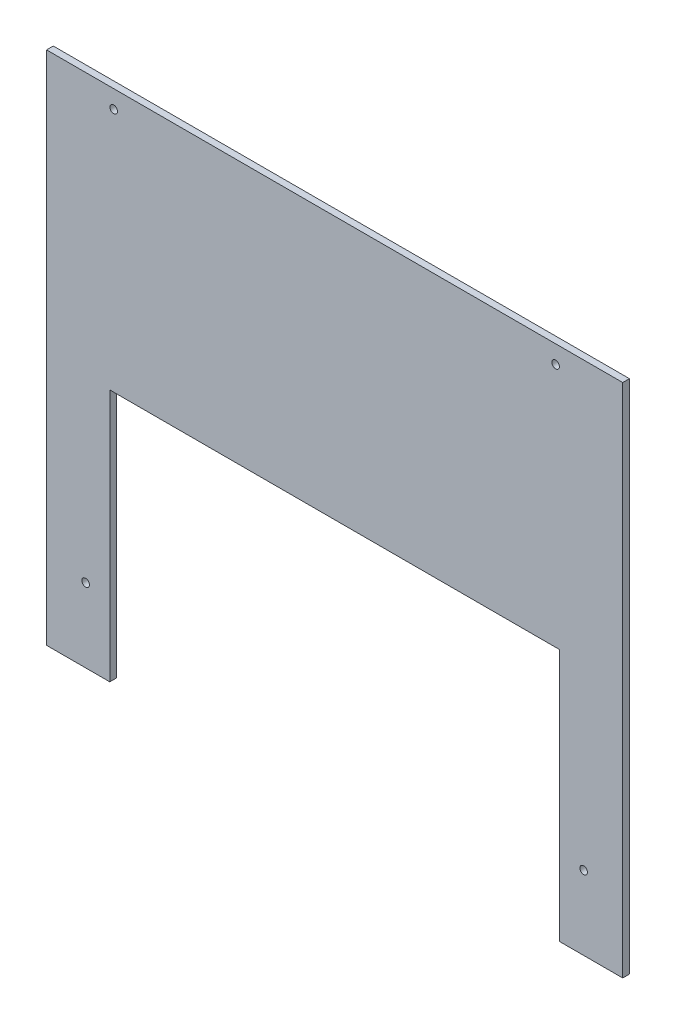
ISO-10303-21;
HEADER;
FILE_DESCRIPTION(('STEP AP214'),'2;1');
FILE_NAME('part.step','',(''),(''),'','','');
FILE_SCHEMA(('AUTOMOTIVE_DESIGN { 1 0 10303 214 1 1 1 1 }'));
ENDSEC;
DATA;
#1=APPLICATION_CONTEXT('core data for automotive mechanical design processes');
#2=APPLICATION_PROTOCOL_DEFINITION('international standard','automotive_design',2000,#1);
#3=PRODUCT_CONTEXT('',#1,'mechanical');
#4=PRODUCT('Part','Part','',(#3));
#5=PRODUCT_RELATED_PRODUCT_CATEGORY('part','',(#4));
#6=PRODUCT_DEFINITION_FORMATION('','',#4);
#7=PRODUCT_DEFINITION_CONTEXT('part definition',#1,'design');
#8=PRODUCT_DEFINITION('design','',#6,#7);
#9=PRODUCT_DEFINITION_SHAPE('','',#8);
#10=(LENGTH_UNIT() NAMED_UNIT(*) SI_UNIT(.MILLI.,.METRE.));
#11=(NAMED_UNIT(*) PLANE_ANGLE_UNIT() SI_UNIT($,.RADIAN.));
#12=(NAMED_UNIT(*) SI_UNIT($,.STERADIAN.) SOLID_ANGLE_UNIT());
#13=UNCERTAINTY_MEASURE_WITH_UNIT(LENGTH_MEASURE(1.E-05),#10,'distance_accuracy_value','');
#14=(GEOMETRIC_REPRESENTATION_CONTEXT(3) GLOBAL_UNCERTAINTY_ASSIGNED_CONTEXT((#13)) GLOBAL_UNIT_ASSIGNED_CONTEXT((#10,
#11,#12)) REPRESENTATION_CONTEXT('',''));
#15=CARTESIAN_POINT('',(0.,0.,0.));
#16=DIRECTION('',(0.,0.,1.));
#17=DIRECTION('',(1.,0.,0.));
#18=AXIS2_PLACEMENT_3D('',#15,#16,#17);
#19=CARTESIAN_POINT('',(0.,0.,3.));
#20=DIRECTION('',(0.,0.,1.));
#21=DIRECTION('',(1.,0.,0.));
#22=AXIS2_PLACEMENT_3D('',#19,#20,#21);
#23=PLANE('',#22);
#24=CARTESIAN_POINT('',(227.51,-7.99999999999998,3.));
#25=DIRECTION('',(0.,0.,1.));
#26=DIRECTION('',(1.,0.,0.));
#27=AXIS2_PLACEMENT_3D('',#24,#25,#26);
#28=CIRCLE('',#27,1.70000000000001);
#29=CARTESIAN_POINT('',(229.21,-7.99999999999998,3.));
#30=VERTEX_POINT('',#29);
#31=EDGE_CURVE('E194',#30,#30,#28,.T.);
#32=ORIENTED_EDGE('',*,*,#31,.F.);
#33=EDGE_LOOP('',(#32));
#34=FACE_BOUND('',#33,.T.);
#35=CARTESIAN_POINT('',(17.455,-197.48,3.));
#36=DIRECTION('',(0.,0.,1.));
#37=DIRECTION('',(1.,0.,0.));
#38=AXIS2_PLACEMENT_3D('',#35,#36,#37);
#39=CIRCLE('',#38,1.70000000000001);
#40=CARTESIAN_POINT('',(19.1550000000001,-197.48,3.));
#41=VERTEX_POINT('',#40);
#42=EDGE_CURVE('E140',#41,#41,#39,.T.);
#43=ORIENTED_EDGE('',*,*,#42,.F.);
#44=EDGE_LOOP('',(#43));
#45=FACE_BOUND('',#44,.T.);
#46=DIRECTION('',(0.,-1.,0.));
#47=VECTOR('',#46,1.);
#48=CARTESIAN_POINT('',(0.,0.,3.));
#49=LINE('',#48,#47);
#50=CARTESIAN_POINT('',(0.,0.,3.));
#51=VERTEX_POINT('',#50);
#52=CARTESIAN_POINT('',(0.,-230.48,3.));
#53=VERTEX_POINT('',#52);
#54=EDGE_CURVE('E151',#51,#53,#49,.T.);
#55=ORIENTED_EDGE('',*,*,#54,.T.);
#56=DIRECTION('',(1.,0.,0.));
#57=VECTOR('',#56,1.);
#58=CARTESIAN_POINT('',(0.,-230.48,3.));
#59=LINE('',#58,#57);
#60=CARTESIAN_POINT('',(28.255,-230.48,3.));
#61=VERTEX_POINT('',#60);
#62=EDGE_CURVE('E99',#53,#61,#59,.T.);
#63=ORIENTED_EDGE('',*,*,#62,.T.);
#64=DIRECTION('',(0.,1.,0.));
#65=VECTOR('',#64,1.);
#66=CARTESIAN_POINT('',(28.255,-230.48,3.));
#67=LINE('',#66,#65);
#68=CARTESIAN_POINT('',(28.255,-117.48,3.));
#69=VERTEX_POINT('',#68);
#70=EDGE_CURVE('E166',#61,#69,#67,.T.);
#71=ORIENTED_EDGE('',*,*,#70,.T.);
#72=DIRECTION('',(1.,0.,0.));
#73=VECTOR('',#72,1.);
#74=CARTESIAN_POINT('',(28.255,-117.48,3.));
#75=LINE('',#74,#73);
#76=CARTESIAN_POINT('',(229.255,-117.48,3.));
#77=VERTEX_POINT('',#76);
#78=EDGE_CURVE('E179',#69,#77,#75,.T.);
#79=ORIENTED_EDGE('',*,*,#78,.T.);
#80=DIRECTION('',(0.,-1.,0.));
#81=VECTOR('',#80,1.);
#82=CARTESIAN_POINT('',(229.255,-230.48,3.));
#83=LINE('',#82,#81);
#84=CARTESIAN_POINT('',(229.255,-230.48,3.));
#85=VERTEX_POINT('',#84);
#86=EDGE_CURVE('E118',#77,#85,#83,.T.);
#87=ORIENTED_EDGE('',*,*,#86,.T.);
#88=DIRECTION('',(1.,0.,0.));
#89=VECTOR('',#88,1.);
#90=CARTESIAN_POINT('',(229.255,-230.48,3.));
#91=LINE('',#90,#89);
#92=CARTESIAN_POINT('',(257.51,-230.48,3.));
#93=VERTEX_POINT('',#92);
#94=EDGE_CURVE('E112',#85,#93,#91,.T.);
#95=ORIENTED_EDGE('',*,*,#94,.T.);
#96=DIRECTION('',(0.,1.,0.));
#97=VECTOR('',#96,1.);
#98=CARTESIAN_POINT('',(257.51,0.,3.));
#99=LINE('',#98,#97);
#100=CARTESIAN_POINT('',(257.51,0.,3.));
#101=VERTEX_POINT('',#100);
#102=EDGE_CURVE('E116',#93,#101,#99,.T.);
#103=ORIENTED_EDGE('',*,*,#102,.T.);
#104=DIRECTION('',(-1.,0.,0.));
#105=VECTOR('',#104,1.);
#106=CARTESIAN_POINT('',(0.,0.,3.));
#107=LINE('',#106,#105);
#108=EDGE_CURVE('E56',#101,#51,#107,.T.);
#109=ORIENTED_EDGE('',*,*,#108,.T.);
#110=EDGE_LOOP('',(#55,#63,#71,#79,#87,#95,#103,#109));
#111=FACE_BOUND('',#110,.T.);
#112=CARTESIAN_POINT('',(240.055,-197.48,3.));
#113=DIRECTION('',(0.,0.,1.));
#114=DIRECTION('',(1.,0.,0.));
#115=AXIS2_PLACEMENT_3D('',#112,#113,#114);
#116=CIRCLE('',#115,1.69999999999995);
#117=CARTESIAN_POINT('',(241.755,-197.48,3.));
#118=VERTEX_POINT('',#117);
#119=EDGE_CURVE('E188',#118,#118,#116,.T.);
#120=ORIENTED_EDGE('',*,*,#119,.F.);
#121=EDGE_LOOP('',(#120));
#122=FACE_BOUND('',#121,.T.);
#123=CARTESIAN_POINT('',(30.,-8.,3.));
#124=DIRECTION('',(0.,0.,1.));
#125=DIRECTION('',(1.,0.,0.));
#126=AXIS2_PLACEMENT_3D('',#123,#124,#125);
#127=CIRCLE('',#126,1.7);
#128=CARTESIAN_POINT('',(31.7,-8.,3.));
#129=VERTEX_POINT('',#128);
#130=EDGE_CURVE('E200',#129,#129,#127,.T.);
#131=ORIENTED_EDGE('',*,*,#130,.F.);
#132=EDGE_LOOP('',(#131));
#133=FACE_BOUND('',#132,.T.);
#134=ADVANCED_FACE('F39',(#34,#45,#111,#122,#133),#23,.T.);
#135=CARTESIAN_POINT('',(0.,0.,0.));
#136=DIRECTION('',(0.,0.,1.));
#137=DIRECTION('',(1.,0.,0.));
#138=AXIS2_PLACEMENT_3D('',#135,#136,#137);
#139=PLANE('',#138);
#140=DIRECTION('',(0.,-1.,0.));
#141=VECTOR('',#140,1.);
#142=CARTESIAN_POINT('',(0.,0.,0.));
#143=LINE('',#142,#141);
#144=CARTESIAN_POINT('',(0.,0.,0.));
#145=VERTEX_POINT('',#144);
#146=CARTESIAN_POINT('',(0.,-230.48,0.));
#147=VERTEX_POINT('',#146);
#148=EDGE_CURVE('E136',#145,#147,#143,.T.);
#149=ORIENTED_EDGE('',*,*,#148,.F.);
#150=DIRECTION('',(-1.,0.,0.));
#151=VECTOR('',#150,1.);
#152=CARTESIAN_POINT('',(0.,0.,0.));
#153=LINE('',#152,#151);
#154=CARTESIAN_POINT('',(257.51,0.,0.));
#155=VERTEX_POINT('',#154);
#156=EDGE_CURVE('E91',#155,#145,#153,.T.);
#157=ORIENTED_EDGE('',*,*,#156,.F.);
#158=DIRECTION('',(0.,1.,0.));
#159=VECTOR('',#158,1.);
#160=CARTESIAN_POINT('',(257.51,0.,0.));
#161=LINE('',#160,#159);
#162=CARTESIAN_POINT('',(257.51,-230.48,0.));
#163=VERTEX_POINT('',#162);
#164=EDGE_CURVE('E85',#163,#155,#161,.T.);
#165=ORIENTED_EDGE('',*,*,#164,.F.);
#166=DIRECTION('',(1.,0.,0.));
#167=VECTOR('',#166,1.);
#168=CARTESIAN_POINT('',(229.255,-230.48,0.));
#169=LINE('',#168,#167);
#170=CARTESIAN_POINT('',(229.255,-230.48,0.));
#171=VERTEX_POINT('',#170);
#172=EDGE_CURVE('E126',#171,#163,#169,.T.);
#173=ORIENTED_EDGE('',*,*,#172,.F.);
#174=DIRECTION('',(0.,-1.,0.));
#175=VECTOR('',#174,1.);
#176=CARTESIAN_POINT('',(229.255,-230.48,0.));
#177=LINE('',#176,#175);
#178=CARTESIAN_POINT('',(229.255,-117.48,0.));
#179=VERTEX_POINT('',#178);
#180=EDGE_CURVE('E146',#179,#171,#177,.T.);
#181=ORIENTED_EDGE('',*,*,#180,.F.);
#182=DIRECTION('',(1.,0.,0.));
#183=VECTOR('',#182,1.);
#184=CARTESIAN_POINT('',(28.255,-117.48,0.));
#185=LINE('',#184,#183);
#186=CARTESIAN_POINT('',(28.255,-117.48,0.));
#187=VERTEX_POINT('',#186);
#188=EDGE_CURVE('E144',#187,#179,#185,.T.);
#189=ORIENTED_EDGE('',*,*,#188,.F.);
#190=DIRECTION('',(0.,1.,0.));
#191=VECTOR('',#190,1.);
#192=CARTESIAN_POINT('',(28.255,-230.48,0.));
#193=LINE('',#192,#191);
#194=CARTESIAN_POINT('',(28.255,-230.48,0.));
#195=VERTEX_POINT('',#194);
#196=EDGE_CURVE('E142',#195,#187,#193,.T.);
#197=ORIENTED_EDGE('',*,*,#196,.F.);
#198=DIRECTION('',(1.,0.,0.));
#199=VECTOR('',#198,1.);
#200=CARTESIAN_POINT('',(0.,-230.48,0.));
#201=LINE('',#200,#199);
#202=EDGE_CURVE('E139',#147,#195,#201,.T.);
#203=ORIENTED_EDGE('',*,*,#202,.F.);
#204=EDGE_LOOP('',(#149,#157,#165,#173,#181,#189,#197,#203));
#205=FACE_BOUND('',#204,.T.);
#206=CARTESIAN_POINT('',(17.455,-197.48,0.));
#207=DIRECTION('',(0.,0.,1.));
#208=DIRECTION('',(1.,0.,0.));
#209=AXIS2_PLACEMENT_3D('',#206,#207,#208);
#210=CIRCLE('',#209,1.70000000000001);
#211=CARTESIAN_POINT('',(19.1550000000001,-197.48,0.));
#212=VERTEX_POINT('',#211);
#213=EDGE_CURVE('E185',#212,#212,#210,.T.);
#214=ORIENTED_EDGE('',*,*,#213,.T.);
#215=EDGE_LOOP('',(#214));
#216=FACE_BOUND('',#215,.T.);
#217=CARTESIAN_POINT('',(240.055,-197.48,0.));
#218=DIRECTION('',(0.,0.,1.));
#219=DIRECTION('',(1.,0.,0.));
#220=AXIS2_PLACEMENT_3D('',#217,#218,#219);
#221=CIRCLE('',#220,1.69999999999995);
#222=CARTESIAN_POINT('',(241.755,-197.48,0.));
#223=VERTEX_POINT('',#222);
#224=EDGE_CURVE('E191',#223,#223,#221,.T.);
#225=ORIENTED_EDGE('',*,*,#224,.T.);
#226=EDGE_LOOP('',(#225));
#227=FACE_BOUND('',#226,.T.);
#228=CARTESIAN_POINT('',(227.51,-7.99999999999998,0.));
#229=DIRECTION('',(0.,0.,1.));
#230=DIRECTION('',(1.,0.,0.));
#231=AXIS2_PLACEMENT_3D('',#228,#229,#230);
#232=CIRCLE('',#231,1.70000000000001);
#233=CARTESIAN_POINT('',(229.21,-7.99999999999998,0.));
#234=VERTEX_POINT('',#233);
#235=EDGE_CURVE('E197',#234,#234,#232,.T.);
#236=ORIENTED_EDGE('',*,*,#235,.T.);
#237=EDGE_LOOP('',(#236));
#238=FACE_BOUND('',#237,.T.);
#239=CARTESIAN_POINT('',(30.,-8.,0.));
#240=DIRECTION('',(0.,0.,1.));
#241=DIRECTION('',(1.,0.,0.));
#242=AXIS2_PLACEMENT_3D('',#239,#240,#241);
#243=CIRCLE('',#242,1.7);
#244=CARTESIAN_POINT('',(31.7,-8.,0.));
#245=VERTEX_POINT('',#244);
#246=EDGE_CURVE('E203',#245,#245,#243,.T.);
#247=ORIENTED_EDGE('',*,*,#246,.T.);
#248=EDGE_LOOP('',(#247));
#249=FACE_BOUND('',#248,.T.);
#250=ADVANCED_FACE('F170',(#205,#216,#227,#238,#249),#139,.F.);
#251=CARTESIAN_POINT('',(0.,0.,3.));
#252=DIRECTION('',(1.,0.,0.));
#253=DIRECTION('',(0.,1.,0.));
#254=AXIS2_PLACEMENT_3D('',#251,#252,#253);
#255=PLANE('',#254);
#256=ORIENTED_EDGE('',*,*,#148,.T.);
#257=DIRECTION('',(0.,0.,-1.));
#258=VECTOR('',#257,1.);
#259=CARTESIAN_POINT('',(0.,-230.48,3.));
#260=LINE('',#259,#258);
#261=EDGE_CURVE('E11',#53,#147,#260,.T.);
#262=ORIENTED_EDGE('',*,*,#261,.F.);
#263=ORIENTED_EDGE('',*,*,#54,.F.);
#264=DIRECTION('',(0.,0.,-1.));
#265=VECTOR('',#264,1.);
#266=CARTESIAN_POINT('',(0.,0.,3.));
#267=LINE('',#266,#265);
#268=EDGE_CURVE('E132',#51,#145,#267,.T.);
#269=ORIENTED_EDGE('',*,*,#268,.T.);
#270=EDGE_LOOP('',(#256,#262,#263,#269));
#271=FACE_BOUND('',#270,.T.);
#272=ADVANCED_FACE('F41',(#271),#255,.F.);
#273=CARTESIAN_POINT('',(0.,-230.48,3.));
#274=DIRECTION('',(0.,1.,0.));
#275=DIRECTION('',(0.,0.,1.));
#276=AXIS2_PLACEMENT_3D('',#273,#274,#275);
#277=PLANE('',#276);
#278=ORIENTED_EDGE('',*,*,#202,.T.);
#279=DIRECTION('',(0.,0.,-1.));
#280=VECTOR('',#279,1.);
#281=CARTESIAN_POINT('',(28.255,-230.48,3.));
#282=LINE('',#281,#280);
#283=EDGE_CURVE('E48',#61,#195,#282,.T.);
#284=ORIENTED_EDGE('',*,*,#283,.F.);
#285=ORIENTED_EDGE('',*,*,#62,.F.);
#286=ORIENTED_EDGE('',*,*,#261,.T.);
#287=EDGE_LOOP('',(#278,#284,#285,#286));
#288=FACE_BOUND('',#287,.T.);
#289=ADVANCED_FACE('F237',(#288),#277,.F.);
#290=CARTESIAN_POINT('',(28.255,-230.48,3.));
#291=DIRECTION('',(-1.,0.,0.));
#292=DIRECTION('',(0.,-1.,0.));
#293=AXIS2_PLACEMENT_3D('',#290,#291,#292);
#294=PLANE('',#293);
#295=ORIENTED_EDGE('',*,*,#196,.T.);
#296=DIRECTION('',(0.,0.,-1.));
#297=VECTOR('',#296,1.);
#298=CARTESIAN_POINT('',(28.255,-117.48,3.));
#299=LINE('',#298,#297);
#300=EDGE_CURVE('E158',#69,#187,#299,.T.);
#301=ORIENTED_EDGE('',*,*,#300,.F.);
#302=ORIENTED_EDGE('',*,*,#70,.F.);
#303=ORIENTED_EDGE('',*,*,#283,.T.);
#304=EDGE_LOOP('',(#295,#301,#302,#303));
#305=FACE_BOUND('',#304,.T.);
#306=ADVANCED_FACE('F164',(#305),#294,.F.);
#307=CARTESIAN_POINT('',(28.255,-117.48,3.));
#308=DIRECTION('',(0.,1.,0.));
#309=DIRECTION('',(-1.,0.,0.));
#310=AXIS2_PLACEMENT_3D('',#307,#308,#309);
#311=PLANE('',#310);
#312=ORIENTED_EDGE('',*,*,#188,.T.);
#313=DIRECTION('',(0.,0.,-1.));
#314=VECTOR('',#313,1.);
#315=CARTESIAN_POINT('',(229.255,-117.48,3.));
#316=LINE('',#315,#314);
#317=EDGE_CURVE('E155',#77,#179,#316,.T.);
#318=ORIENTED_EDGE('',*,*,#317,.F.);
#319=ORIENTED_EDGE('',*,*,#78,.F.);
#320=ORIENTED_EDGE('',*,*,#300,.T.);
#321=EDGE_LOOP('',(#312,#318,#319,#320));
#322=FACE_BOUND('',#321,.T.);
#323=ADVANCED_FACE('F175',(#322),#311,.F.);
#324=CARTESIAN_POINT('',(229.255,-230.48,3.));
#325=DIRECTION('',(1.,0.,0.));
#326=DIRECTION('',(0.,1.,0.));
#327=AXIS2_PLACEMENT_3D('',#324,#325,#326);
#328=PLANE('',#327);
#329=ORIENTED_EDGE('',*,*,#180,.T.);
#330=DIRECTION('',(0.,0.,-1.));
#331=VECTOR('',#330,1.);
#332=CARTESIAN_POINT('',(229.255,-230.48,3.));
#333=LINE('',#332,#331);
#334=EDGE_CURVE('E127',#85,#171,#333,.T.);
#335=ORIENTED_EDGE('',*,*,#334,.F.);
#336=ORIENTED_EDGE('',*,*,#86,.F.);
#337=ORIENTED_EDGE('',*,*,#317,.T.);
#338=EDGE_LOOP('',(#329,#335,#336,#337));
#339=FACE_BOUND('',#338,.T.);
#340=ADVANCED_FACE('F178',(#339),#328,.F.);
#341=CARTESIAN_POINT('',(229.255,-230.48,3.));
#342=DIRECTION('',(0.,1.,0.));
#343=DIRECTION('',(0.,0.,1.));
#344=AXIS2_PLACEMENT_3D('',#341,#342,#343);
#345=PLANE('',#344);
#346=ORIENTED_EDGE('',*,*,#172,.T.);
#347=DIRECTION('',(0.,0.,-1.));
#348=VECTOR('',#347,1.);
#349=CARTESIAN_POINT('',(257.51,-230.48,3.));
#350=LINE('',#349,#348);
#351=EDGE_CURVE('E123',#93,#163,#350,.T.);
#352=ORIENTED_EDGE('',*,*,#351,.F.);
#353=ORIENTED_EDGE('',*,*,#94,.F.);
#354=ORIENTED_EDGE('',*,*,#334,.T.);
#355=EDGE_LOOP('',(#346,#352,#353,#354));
#356=FACE_BOUND('',#355,.T.);
#357=ADVANCED_FACE('F124',(#356),#345,.F.);
#358=CARTESIAN_POINT('',(257.51,0.,3.));
#359=DIRECTION('',(-1.,0.,0.));
#360=DIRECTION('',(0.,-1.,0.));
#361=AXIS2_PLACEMENT_3D('',#358,#359,#360);
#362=PLANE('',#361);
#363=ORIENTED_EDGE('',*,*,#164,.T.);
#364=DIRECTION('',(0.,0.,-1.));
#365=VECTOR('',#364,1.);
#366=CARTESIAN_POINT('',(257.51,0.,3.));
#367=LINE('',#366,#365);
#368=EDGE_CURVE('E128',#101,#155,#367,.T.);
#369=ORIENTED_EDGE('',*,*,#368,.F.);
#370=ORIENTED_EDGE('',*,*,#102,.F.);
#371=ORIENTED_EDGE('',*,*,#351,.T.);
#372=EDGE_LOOP('',(#363,#369,#370,#371));
#373=FACE_BOUND('',#372,.T.);
#374=ADVANCED_FACE('F130',(#373),#362,.F.);
#375=CARTESIAN_POINT('',(0.,0.,3.));
#376=DIRECTION('',(0.,-1.,0.));
#377=DIRECTION('',(1.,0.,0.));
#378=AXIS2_PLACEMENT_3D('',#375,#376,#377);
#379=PLANE('',#378);
#380=ORIENTED_EDGE('',*,*,#156,.T.);
#381=ORIENTED_EDGE('',*,*,#268,.F.);
#382=ORIENTED_EDGE('',*,*,#108,.F.);
#383=ORIENTED_EDGE('',*,*,#368,.T.);
#384=EDGE_LOOP('',(#380,#381,#382,#383));
#385=FACE_BOUND('',#384,.T.);
#386=ADVANCED_FACE('F225',(#385),#379,.F.);
#387=CARTESIAN_POINT('',(17.455,-197.48,3.));
#388=DIRECTION('',(0.,0.,-1.));
#389=DIRECTION('',(-1.,0.,0.));
#390=AXIS2_PLACEMENT_3D('',#387,#388,#389);
#391=CYLINDRICAL_SURFACE('',#390,1.70000000000001);
#392=ORIENTED_EDGE('',*,*,#42,.T.);
#393=EDGE_LOOP('',(#392));
#394=FACE_BOUND('',#393,.T.);
#395=ORIENTED_EDGE('',*,*,#213,.F.);
#396=EDGE_LOOP('',(#395));
#397=FACE_BOUND('',#396,.T.);
#398=ADVANCED_FACE('F222',(#394,#397),#391,.F.);
#399=CARTESIAN_POINT('',(240.055,-197.48,3.));
#400=DIRECTION('',(0.,0.,-1.));
#401=DIRECTION('',(-1.,0.,0.));
#402=AXIS2_PLACEMENT_3D('',#399,#400,#401);
#403=CYLINDRICAL_SURFACE('',#402,1.69999999999995);
#404=ORIENTED_EDGE('',*,*,#119,.T.);
#405=EDGE_LOOP('',(#404));
#406=FACE_BOUND('',#405,.T.);
#407=ORIENTED_EDGE('',*,*,#224,.F.);
#408=EDGE_LOOP('',(#407));
#409=FACE_BOUND('',#408,.T.);
#410=ADVANCED_FACE('F300',(#406,#409),#403,.F.);
#411=CARTESIAN_POINT('',(227.51,-7.99999999999998,3.));
#412=DIRECTION('',(0.,0.,-1.));
#413=DIRECTION('',(-1.,0.,0.));
#414=AXIS2_PLACEMENT_3D('',#411,#412,#413);
#415=CYLINDRICAL_SURFACE('',#414,1.70000000000001);
#416=ORIENTED_EDGE('',*,*,#31,.T.);
#417=EDGE_LOOP('',(#416));
#418=FACE_BOUND('',#417,.T.);
#419=ORIENTED_EDGE('',*,*,#235,.F.);
#420=EDGE_LOOP('',(#419));
#421=FACE_BOUND('',#420,.T.);
#422=ADVANCED_FACE('F308',(#418,#421),#415,.F.);
#423=CARTESIAN_POINT('',(30.,-8.,3.));
#424=DIRECTION('',(0.,0.,-1.));
#425=DIRECTION('',(-1.,0.,0.));
#426=AXIS2_PLACEMENT_3D('',#423,#424,#425);
#427=CYLINDRICAL_SURFACE('',#426,1.7);
#428=ORIENTED_EDGE('',*,*,#130,.T.);
#429=EDGE_LOOP('',(#428));
#430=FACE_BOUND('',#429,.T.);
#431=ORIENTED_EDGE('',*,*,#246,.F.);
#432=EDGE_LOOP('',(#431));
#433=FACE_BOUND('',#432,.T.);
#434=ADVANCED_FACE('F209',(#430,#433),#427,.F.);
#435=CLOSED_SHELL('',(#134,#250,#272,#289,#306,#323,#340,#357,#374,#386,#398,#410,#422,#434));
#436=MANIFOLD_SOLID_BREP('B2',#435);
#437=ADVANCED_BREP_SHAPE_REPRESENTATION('',(#18,#436),#14);
#438=SHAPE_DEFINITION_REPRESENTATION(#9,#437);
ENDSEC;
END-ISO-10303-21;
